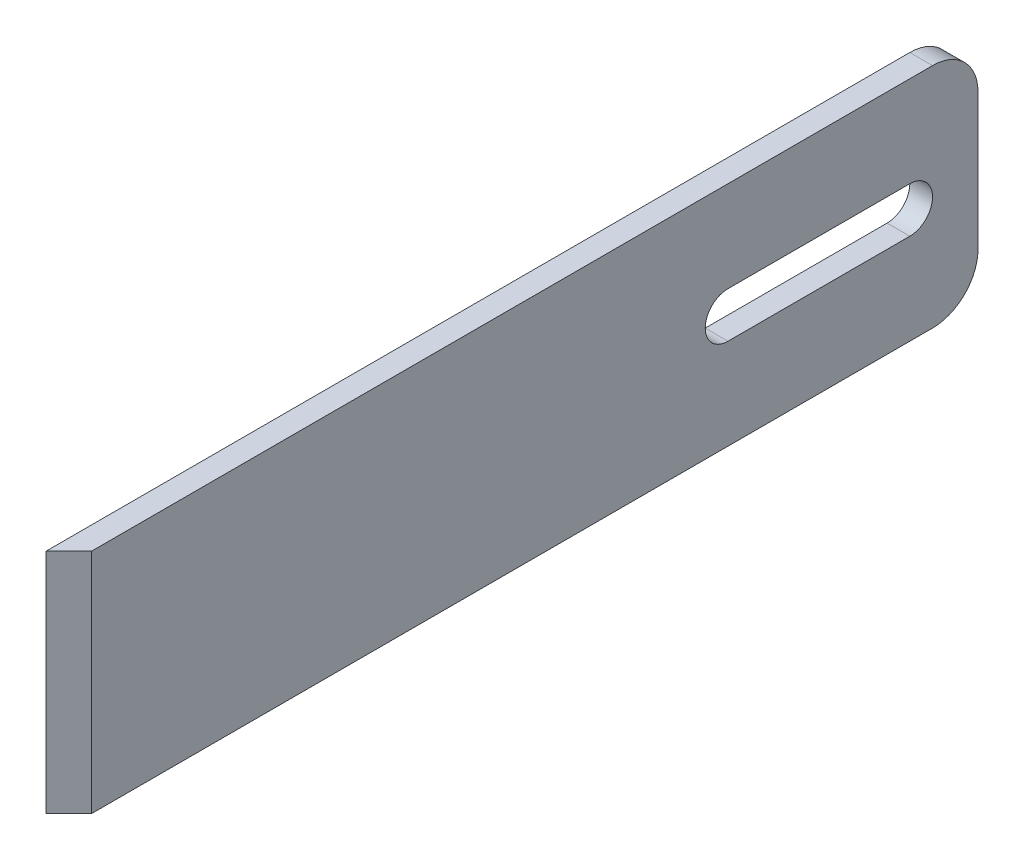
ISO-10303-21;
HEADER;
FILE_DESCRIPTION(('STEP AP214'),'2;1');
FILE_NAME('part.step','',(''),(''),'','','');
FILE_SCHEMA(('AUTOMOTIVE_DESIGN { 1 0 10303 214 1 1 1 1 }'));
ENDSEC;
DATA;
#1=APPLICATION_CONTEXT('core data for automotive mechanical design processes');
#2=APPLICATION_PROTOCOL_DEFINITION('international standard','automotive_design',2000,#1);
#3=PRODUCT_CONTEXT('',#1,'mechanical');
#4=PRODUCT('Part','Part','',(#3));
#5=PRODUCT_RELATED_PRODUCT_CATEGORY('part','',(#4));
#6=PRODUCT_DEFINITION_FORMATION('','',#4);
#7=PRODUCT_DEFINITION_CONTEXT('part definition',#1,'design');
#8=PRODUCT_DEFINITION('design','',#6,#7);
#9=PRODUCT_DEFINITION_SHAPE('','',#8);
#10=(LENGTH_UNIT() NAMED_UNIT(*) SI_UNIT(.MILLI.,.METRE.));
#11=(NAMED_UNIT(*) PLANE_ANGLE_UNIT() SI_UNIT($,.RADIAN.));
#12=(NAMED_UNIT(*) SI_UNIT($,.STERADIAN.) SOLID_ANGLE_UNIT());
#13=UNCERTAINTY_MEASURE_WITH_UNIT(LENGTH_MEASURE(1.E-05),#10,'distance_accuracy_value','');
#14=(GEOMETRIC_REPRESENTATION_CONTEXT(3) GLOBAL_UNCERTAINTY_ASSIGNED_CONTEXT((#13)) GLOBAL_UNIT_ASSIGNED_CONTEXT((#10,
#11,#12)) REPRESENTATION_CONTEXT('',''));
#15=CARTESIAN_POINT('',(0.,0.,0.));
#16=DIRECTION('',(0.,0.,1.));
#17=DIRECTION('',(1.,0.,0.));
#18=AXIS2_PLACEMENT_3D('',#15,#16,#17);
#19=CARTESIAN_POINT('',(-2.50000000000253,-24.9999999999998,-99.9999999999989));
#20=DIRECTION('',(0.,0.999999999999993,0.));
#21=DIRECTION('',(0.,0.,1.));
#22=AXIS2_PLACEMENT_3D('',#19,#20,#21);
#23=PLANE('',#22);
#24=DIRECTION('',(0.,0.,1.));
#25=VECTOR('',#24,1.);
#26=CARTESIAN_POINT('',(-2.50000000000253,-24.9999999999998,-99.9999999999989));
#27=LINE('',#26,#25);
#28=CARTESIAN_POINT('',(-2.49999999999728,-25.0000000000001,-89.999999999999));
#29=VERTEX_POINT('',#28);
#30=CARTESIAN_POINT('',(-2.50000000000003,-25.000000000001,100.000000000001));
#31=VERTEX_POINT('',#30);
#32=EDGE_CURVE('E165',#29,#31,#27,.T.);
#33=ORIENTED_EDGE('',*,*,#32,.F.);
#34=DIRECTION('',(-0.999999999999995,0.,0.));
#35=VECTOR('',#34,1.);
#36=CARTESIAN_POINT('',(-2.49999999999728,-25.0000000000001,-89.999999999999));
#37=LINE('',#36,#35);
#38=CARTESIAN_POINT('',(2.49999999999953,-25.0000000000001,-89.9999999999988));
#39=VERTEX_POINT('',#38);
#40=EDGE_CURVE('E11',#29,#39,#37,.F.);
#41=ORIENTED_EDGE('',*,*,#40,.T.);
#42=DIRECTION('',(0.,0.,1.));
#43=VECTOR('',#42,1.);
#44=CARTESIAN_POINT('',(2.50000000000003,-24.9999999999999,-99.9999999999984));
#45=LINE('',#44,#43);
#46=CARTESIAN_POINT('',(2.50000000000017,-25.0000000000001,95.0000000000012));
#47=VERTEX_POINT('',#46);
#48=EDGE_CURVE('E157',#39,#47,#45,.T.);
#49=ORIENTED_EDGE('',*,*,#48,.T.);
#50=DIRECTION('',(-0.707106781186552,0.,0.707106781186546));
#51=VECTOR('',#50,1.);
#52=CARTESIAN_POINT('',(2.50000000000017,-25.0000000000001,95.0000000000012));
#53=LINE('',#52,#51);
#54=EDGE_CURVE('E170',#47,#31,#53,.T.);
#55=ORIENTED_EDGE('',*,*,#54,.T.);
#56=EDGE_LOOP('',(#33,#41,#49,#55));
#57=FACE_BOUND('',#56,.T.);
#58=ADVANCED_FACE('F38',(#57),#23,.F.);
#59=CARTESIAN_POINT('',(-2.50000000000253,-24.9999999999998,-99.9999999999989));
#60=DIRECTION('',(0.999999999999995,0.,0.));
#61=DIRECTION('',(0.,0.,-1.));
#62=AXIS2_PLACEMENT_3D('',#59,#60,#61);
#63=PLANE('',#62);
#64=DIRECTION('',(0.,0.,-1.));
#65=VECTOR('',#64,1.);
#66=CARTESIAN_POINT('',(-2.50000000000028,5.00000000000153,-44.9999999999988));
#67=LINE('',#66,#65);
#68=CARTESIAN_POINT('',(-2.50000000000028,5.00000000000153,-44.9999999999988));
#69=VERTEX_POINT('',#68);
#70=CARTESIAN_POINT('',(-2.50000000000275,4.99999999999989,-84.9999999999991));
#71=VERTEX_POINT('',#70);
#72=EDGE_CURVE('E134',#69,#71,#67,.T.);
#73=ORIENTED_EDGE('',*,*,#72,.F.);
#74=CARTESIAN_POINT('',(-2.50000000000075,4.44089209850063E-13,-44.9999999999992));
#75=DIRECTION('',(0.999999999999995,0.,0.));
#76=DIRECTION('',(0.,0.,-1.));
#77=AXIS2_PLACEMENT_3D('',#74,#75,#76);
#78=CIRCLE('',#77,5.);
#79=CARTESIAN_POINT('',(-2.49999999999936,-5.00000000000041,-44.9999999999991));
#80=VERTEX_POINT('',#79);
#81=EDGE_CURVE('E116',#80,#69,#78,.F.);
#82=ORIENTED_EDGE('',*,*,#81,.F.);
#83=DIRECTION('',(0.,0.,1.));
#84=VECTOR('',#83,1.);
#85=CARTESIAN_POINT('',(-2.49999999999936,-5.00000000000041,-44.9999999999991));
#86=LINE('',#85,#84);
#87=CARTESIAN_POINT('',(-2.50000000000142,-5.0000000000001,-84.9999999999998));
#88=VERTEX_POINT('',#87);
#89=EDGE_CURVE('E125',#88,#80,#86,.T.);
#90=ORIENTED_EDGE('',*,*,#89,.F.);
#91=CARTESIAN_POINT('',(-2.50000000000114,3.05311331771918E-13,-84.9999999999994));
#92=DIRECTION('',(0.999999999999995,0.,0.));
#93=DIRECTION('',(0.,0.,-1.));
#94=AXIS2_PLACEMENT_3D('',#91,#92,#93);
#95=CIRCLE('',#94,5.);
#96=EDGE_CURVE('E53',#71,#88,#95,.F.);
#97=ORIENTED_EDGE('',*,*,#96,.F.);
#98=EDGE_LOOP('',(#73,#82,#90,#97));
#99=FACE_BOUND('',#98,.T.);
#100=DIRECTION('',(0.,0.,1.));
#101=VECTOR('',#100,1.);
#102=CARTESIAN_POINT('',(-2.5,24.9999999999998,-99.9999999999987));
#103=LINE('',#102,#101);
#104=CARTESIAN_POINT('',(-2.50000000000095,24.9999999999989,-89.9999999999985));
#105=VERTEX_POINT('',#104);
#106=CARTESIAN_POINT('',(-2.49999999999984,24.9999999999995,100.000000000001));
#107=VERTEX_POINT('',#106);
#108=EDGE_CURVE('E163',#105,#107,#103,.T.);
#109=ORIENTED_EDGE('',*,*,#108,.F.);
#110=CARTESIAN_POINT('',(-2.50000000000225,15.0000000000001,-89.9999999999984));
#111=DIRECTION('',(0.999999999999995,0.,0.));
#112=DIRECTION('',(0.,0.,-1.));
#113=AXIS2_PLACEMENT_3D('',#110,#111,#112);
#114=CIRCLE('',#113,10.);
#115=CARTESIAN_POINT('',(-2.50000000000145,15.,-99.9999999999985));
#116=VERTEX_POINT('',#115);
#117=EDGE_CURVE('E46',#105,#116,#114,.F.);
#118=ORIENTED_EDGE('',*,*,#117,.T.);
#119=DIRECTION('',(0.,0.999999999999993,0.));
#120=VECTOR('',#119,1.);
#121=CARTESIAN_POINT('',(-2.50000000000253,-24.9999999999998,-99.9999999999989));
#122=LINE('',#121,#120);
#123=CARTESIAN_POINT('',(-2.4999999999995,-15.0000000000002,-99.9999999999988));
#124=VERTEX_POINT('',#123);
#125=EDGE_CURVE('E151',#124,#116,#122,.T.);
#126=ORIENTED_EDGE('',*,*,#125,.F.);
#127=CARTESIAN_POINT('',(-2.50000000000361,-14.9999999999997,-89.9999999999988));
#128=DIRECTION('',(0.999999999999995,0.,0.));
#129=DIRECTION('',(0.,0.,-1.));
#130=AXIS2_PLACEMENT_3D('',#127,#128,#129);
#131=CIRCLE('',#130,10.);
#132=EDGE_CURVE('E188',#124,#29,#131,.F.);
#133=ORIENTED_EDGE('',*,*,#132,.T.);
#134=ORIENTED_EDGE('',*,*,#32,.T.);
#135=DIRECTION('',(0.,0.999999999999993,0.));
#136=VECTOR('',#135,1.);
#137=CARTESIAN_POINT('',(-2.50000000000003,-25.000000000001,100.000000000001));
#138=LINE('',#137,#136);
#139=EDGE_CURVE('E128',#31,#107,#138,.T.);
#140=ORIENTED_EDGE('',*,*,#139,.T.);
#141=EDGE_LOOP('',(#109,#118,#126,#133,#134,#140));
#142=FACE_BOUND('',#141,.T.);
#143=ADVANCED_FACE('F131',(#99,#142),#63,.F.);
#144=CARTESIAN_POINT('',(2.49999999999978,24.9999999999997,-99.9999999999977));
#145=DIRECTION('',(0.,-0.999999999999993,0.));
#146=DIRECTION('',(0.,0.,-1.));
#147=AXIS2_PLACEMENT_3D('',#144,#145,#146);
#148=PLANE('',#147);
#149=DIRECTION('',(0.,0.,1.));
#150=VECTOR('',#149,1.);
#151=CARTESIAN_POINT('',(2.49999999999978,24.9999999999997,-99.9999999999977));
#152=LINE('',#151,#150);
#153=CARTESIAN_POINT('',(2.49999999999953,25.0000000000004,-89.999999999999));
#154=VERTEX_POINT('',#153);
#155=CARTESIAN_POINT('',(2.50000000000031,24.9999999999985,95.0000000000005));
#156=VERTEX_POINT('',#155);
#157=EDGE_CURVE('E161',#154,#156,#152,.T.);
#158=ORIENTED_EDGE('',*,*,#157,.F.);
#159=DIRECTION('',(0.999999999999995,0.,0.));
#160=VECTOR('',#159,1.);
#161=CARTESIAN_POINT('',(2.49999999999953,25.0000000000004,-89.999999999999));
#162=LINE('',#161,#160);
#163=EDGE_CURVE('E186',#154,#105,#162,.F.);
#164=ORIENTED_EDGE('',*,*,#163,.T.);
#165=ORIENTED_EDGE('',*,*,#108,.T.);
#166=DIRECTION('',(0.707106781186552,0.,-0.707106781186546));
#167=VECTOR('',#166,1.);
#168=CARTESIAN_POINT('',(2.50000000000031,24.9999999999985,95.0000000000005));
#169=LINE('',#168,#167);
#170=EDGE_CURVE('E173',#107,#156,#169,.T.);
#171=ORIENTED_EDGE('',*,*,#170,.T.);
#172=EDGE_LOOP('',(#158,#164,#165,#171));
#173=FACE_BOUND('',#172,.T.);
#174=ADVANCED_FACE('F204',(#173),#148,.F.);
#175=CARTESIAN_POINT('',(2.50000000000003,-24.9999999999999,-99.9999999999984));
#176=DIRECTION('',(-0.999999999999995,0.,0.));
#177=DIRECTION('',(0.,0.,1.));
#178=AXIS2_PLACEMENT_3D('',#175,#176,#177);
#179=PLANE('',#178);
#180=DIRECTION('',(0.,0.,-1.));
#181=VECTOR('',#180,1.);
#182=CARTESIAN_POINT('',(2.49999999999931,-5.00000000000049,-44.9999999999992));
#183=LINE('',#182,#181);
#184=CARTESIAN_POINT('',(2.49999999999931,-5.00000000000049,-44.9999999999992));
#185=VERTEX_POINT('',#184);
#186=CARTESIAN_POINT('',(2.49999999999584,-4.99999999999967,-84.9999999999993));
#187=VERTEX_POINT('',#186);
#188=EDGE_CURVE('E136',#185,#187,#183,.T.);
#189=ORIENTED_EDGE('',*,*,#188,.F.);
#190=CARTESIAN_POINT('',(2.49999999999614,-6.38378239159465E-13,-44.9999999999997));
#191=DIRECTION('',(0.999999999999995,0.,0.));
#192=DIRECTION('',(0.,0.,-1.));
#193=AXIS2_PLACEMENT_3D('',#190,#191,#192);
#194=CIRCLE('',#193,5.);
#195=CARTESIAN_POINT('',(2.50000000000478,5.00000000000149,-44.9999999999993));
#196=VERTEX_POINT('',#195);
#197=EDGE_CURVE('E61',#196,#185,#194,.T.);
#198=ORIENTED_EDGE('',*,*,#197,.F.);
#199=DIRECTION('',(0.,0.,1.));
#200=VECTOR('',#199,1.);
#201=CARTESIAN_POINT('',(2.50000000000478,5.00000000000149,-44.9999999999993));
#202=LINE('',#201,#200);
#203=CARTESIAN_POINT('',(2.49999999999778,4.99999999999988,-85.));
#204=VERTEX_POINT('',#203);
#205=EDGE_CURVE('E122',#204,#196,#202,.T.);
#206=ORIENTED_EDGE('',*,*,#205,.F.);
#207=CARTESIAN_POINT('',(2.49999999999745,1.65145674912992E-12,-84.9999999999987));
#208=DIRECTION('',(0.999999999999995,0.,0.));
#209=DIRECTION('',(0.,0.,-1.));
#210=AXIS2_PLACEMENT_3D('',#207,#208,#209);
#211=CIRCLE('',#210,5.);
#212=EDGE_CURVE('E142',#187,#204,#211,.T.);
#213=ORIENTED_EDGE('',*,*,#212,.F.);
#214=EDGE_LOOP('',(#189,#198,#206,#213));
#215=FACE_BOUND('',#214,.T.);
#216=DIRECTION('',(0.,-0.999999999999993,0.));
#217=VECTOR('',#216,1.);
#218=CARTESIAN_POINT('',(2.50000000000003,-24.9999999999999,-99.9999999999984));
#219=LINE('',#218,#217);
#220=CARTESIAN_POINT('',(2.49999999999209,15.0000000000001,-99.9999999999995));
#221=VERTEX_POINT('',#220);
#222=CARTESIAN_POINT('',(2.49999999999723,-15.0000000000001,-99.9999999999983));
#223=VERTEX_POINT('',#222);
#224=EDGE_CURVE('E154',#221,#223,#219,.T.);
#225=ORIENTED_EDGE('',*,*,#224,.F.);
#226=CARTESIAN_POINT('',(2.49999999999512,14.999999999999,-89.9999999999992));
#227=DIRECTION('',(-0.999999999999995,0.,0.));
#228=DIRECTION('',(0.,0.,1.));
#229=AXIS2_PLACEMENT_3D('',#226,#227,#228);
#230=CIRCLE('',#229,10.);
#231=EDGE_CURVE('E184',#221,#154,#230,.F.);
#232=ORIENTED_EDGE('',*,*,#231,.T.);
#233=ORIENTED_EDGE('',*,*,#157,.T.);
#234=DIRECTION('',(0.,-0.999999999999993,0.));
#235=VECTOR('',#234,1.);
#236=CARTESIAN_POINT('',(2.50000000000017,-25.0000000000001,95.0000000000012));
#237=LINE('',#236,#235);
#238=EDGE_CURVE('E167',#156,#47,#237,.T.);
#239=ORIENTED_EDGE('',*,*,#238,.T.);
#240=ORIENTED_EDGE('',*,*,#48,.F.);
#241=CARTESIAN_POINT('',(2.49999999999712,-15.0000000000001,-90.));
#242=DIRECTION('',(-0.999999999999995,0.,0.));
#243=DIRECTION('',(0.,0.,1.));
#244=AXIS2_PLACEMENT_3D('',#241,#242,#243);
#245=CIRCLE('',#244,10.);
#246=EDGE_CURVE('E182',#39,#223,#245,.F.);
#247=ORIENTED_EDGE('',*,*,#246,.T.);
#248=EDGE_LOOP('',(#225,#232,#233,#239,#240,#247));
#249=FACE_BOUND('',#248,.T.);
#250=ADVANCED_FACE('F202',(#215,#249),#179,.F.);
#251=CARTESIAN_POINT('',(-8.1601392309949E-12,6.10622663543836E-13,-99.9999999999982));
#252=DIRECTION('',(0.,0.,1.));
#253=DIRECTION('',(0.999999999999995,0.,0.));
#254=AXIS2_PLACEMENT_3D('',#251,#252,#253);
#255=PLANE('',#254);
#256=ORIENTED_EDGE('',*,*,#125,.T.);
#257=DIRECTION('',(0.999999999999995,0.,0.));
#258=VECTOR('',#257,1.);
#259=CARTESIAN_POINT('',(-3.38618022510673E-12,14.9999999999991,-99.9999999999974));
#260=LINE('',#259,#258);
#261=EDGE_CURVE('E179',#116,#221,#260,.T.);
#262=ORIENTED_EDGE('',*,*,#261,.T.);
#263=ORIENTED_EDGE('',*,*,#224,.T.);
#264=DIRECTION('',(-0.999999999999995,0.,0.));
#265=VECTOR('',#264,1.);
#266=CARTESIAN_POINT('',(-4.9960036108132E-12,-15.0000000000001,-99.9999999999982));
#267=LINE('',#266,#265);
#268=EDGE_CURVE('E176',#223,#124,#267,.T.);
#269=ORIENTED_EDGE('',*,*,#268,.T.);
#270=EDGE_LOOP('',(#256,#262,#263,#269));
#271=FACE_BOUND('',#270,.T.);
#272=ADVANCED_FACE('F196',(#271),#255,.F.);
#273=CARTESIAN_POINT('',(2.50000000000017,-25.0000000000001,95.0000000000012));
#274=DIRECTION('',(0.707106781186545,0.,0.707106781186554));
#275=DIRECTION('',(0.,0.999999999999993,0.));
#276=AXIS2_PLACEMENT_3D('',#273,#274,#275);
#277=PLANE('',#276);
#278=ORIENTED_EDGE('',*,*,#170,.F.);
#279=ORIENTED_EDGE('',*,*,#139,.F.);
#280=ORIENTED_EDGE('',*,*,#54,.F.);
#281=ORIENTED_EDGE('',*,*,#238,.F.);
#282=EDGE_LOOP('',(#278,#279,#280,#281));
#283=FACE_BOUND('',#282,.T.);
#284=ADVANCED_FACE('F210',(#283),#277,.T.);
#285=CARTESIAN_POINT('',(-1.94289029309402E-13,14.9999999999988,-89.9999999999979));
#286=DIRECTION('',(0.999999999999995,0.,0.));
#287=DIRECTION('',(0.,0.,-1.));
#288=AXIS2_PLACEMENT_3D('',#285,#286,#287);
#289=CYLINDRICAL_SURFACE('',#288,10.);
#290=ORIENTED_EDGE('',*,*,#117,.F.);
#291=ORIENTED_EDGE('',*,*,#163,.F.);
#292=ORIENTED_EDGE('',*,*,#231,.F.);
#293=ORIENTED_EDGE('',*,*,#261,.F.);
#294=EDGE_LOOP('',(#290,#291,#292,#293));
#295=FACE_BOUND('',#294,.T.);
#296=ADVANCED_FACE('F199',(#295),#289,.T.);
#297=CARTESIAN_POINT('',(-3.5527136788005E-12,-15.0000000000001,-89.9999999999976));
#298=DIRECTION('',(-0.999999999999995,0.,0.));
#299=DIRECTION('',(0.,0.,1.));
#300=AXIS2_PLACEMENT_3D('',#297,#298,#299);
#301=CYLINDRICAL_SURFACE('',#300,10.);
#302=ORIENTED_EDGE('',*,*,#246,.F.);
#303=ORIENTED_EDGE('',*,*,#40,.F.);
#304=ORIENTED_EDGE('',*,*,#132,.F.);
#305=ORIENTED_EDGE('',*,*,#268,.F.);
#306=EDGE_LOOP('',(#302,#303,#304,#305));
#307=FACE_BOUND('',#306,.T.);
#308=ADVANCED_FACE('F40',(#307),#301,.T.);
#309=CARTESIAN_POINT('',(-2.50099999999853,3.60822483003176E-13,-44.9999999999988));
#310=DIRECTION('',(0.999999999999995,0.,0.));
#311=DIRECTION('',(0.,0.,-1.));
#312=AXIS2_PLACEMENT_3D('',#309,#310,#311);
#313=CYLINDRICAL_SURFACE('',#312,5.);
#314=ORIENTED_EDGE('',*,*,#81,.T.);
#315=DIRECTION('',(0.999999999999995,0.,0.));
#316=VECTOR('',#315,1.);
#317=CARTESIAN_POINT('',(-2.50100000000103,5.00000000000241,-44.9999999999989));
#318=LINE('',#317,#316);
#319=EDGE_CURVE('E129',#69,#196,#318,.T.);
#320=ORIENTED_EDGE('',*,*,#319,.T.);
#321=ORIENTED_EDGE('',*,*,#197,.T.);
#322=DIRECTION('',(0.999999999999995,0.,0.));
#323=VECTOR('',#322,1.);
#324=CARTESIAN_POINT('',(-2.50100000000444,-4.99999999999885,-44.999999999999));
#325=LINE('',#324,#323);
#326=EDGE_CURVE('E112',#80,#185,#325,.T.);
#327=ORIENTED_EDGE('',*,*,#326,.F.);
#328=EDGE_LOOP('',(#314,#320,#321,#327));
#329=FACE_BOUND('',#328,.T.);
#330=ADVANCED_FACE('F114',(#329),#313,.F.);
#331=CARTESIAN_POINT('',(-2.50100000000103,5.00000000000241,-44.9999999999989));
#332=DIRECTION('',(0.,0.999999999999993,0.));
#333=DIRECTION('',(0.,0.,1.));
#334=AXIS2_PLACEMENT_3D('',#331,#332,#333);
#335=PLANE('',#334);
#336=ORIENTED_EDGE('',*,*,#72,.T.);
#337=DIRECTION('',(0.999999999999995,0.,0.));
#338=VECTOR('',#337,1.);
#339=CARTESIAN_POINT('',(-2.50100000000603,4.99999999999982,-85.));
#340=LINE('',#339,#338);
#341=EDGE_CURVE('E148',#71,#204,#340,.T.);
#342=ORIENTED_EDGE('',*,*,#341,.T.);
#343=ORIENTED_EDGE('',*,*,#205,.T.);
#344=ORIENTED_EDGE('',*,*,#319,.F.);
#345=EDGE_LOOP('',(#336,#342,#343,#344));
#346=FACE_BOUND('',#345,.T.);
#347=ADVANCED_FACE('F233',(#346),#335,.F.);
#348=CARTESIAN_POINT('',(-2.50099999999523,2.35922392732846E-13,-84.9999999999987));
#349=DIRECTION('',(0.999999999999995,0.,0.));
#350=DIRECTION('',(0.,0.,-1.));
#351=AXIS2_PLACEMENT_3D('',#348,#349,#350);
#352=CYLINDRICAL_SURFACE('',#351,5.);
#353=ORIENTED_EDGE('',*,*,#96,.T.);
#354=DIRECTION('',(0.999999999999995,0.,0.));
#355=VECTOR('',#354,1.);
#356=CARTESIAN_POINT('',(-2.50100000000403,-4.99999999999967,-84.9999999999994));
#357=LINE('',#356,#355);
#358=EDGE_CURVE('E121',#88,#187,#357,.T.);
#359=ORIENTED_EDGE('',*,*,#358,.T.);
#360=ORIENTED_EDGE('',*,*,#212,.T.);
#361=ORIENTED_EDGE('',*,*,#341,.F.);
#362=EDGE_LOOP('',(#353,#359,#360,#361));
#363=FACE_BOUND('',#362,.T.);
#364=ADVANCED_FACE('F238',(#363),#352,.F.);
#365=CARTESIAN_POINT('',(-2.50100000000444,-4.99999999999885,-44.999999999999));
#366=DIRECTION('',(0.,-0.999999999999993,0.));
#367=DIRECTION('',(0.,0.,-1.));
#368=AXIS2_PLACEMENT_3D('',#365,#366,#367);
#369=PLANE('',#368);
#370=ORIENTED_EDGE('',*,*,#89,.T.);
#371=ORIENTED_EDGE('',*,*,#326,.T.);
#372=ORIENTED_EDGE('',*,*,#188,.T.);
#373=ORIENTED_EDGE('',*,*,#358,.F.);
#374=EDGE_LOOP('',(#370,#371,#372,#373));
#375=FACE_BOUND('',#374,.T.);
#376=ADVANCED_FACE('F126',(#375),#369,.F.);
#377=CLOSED_SHELL('',(#58,#143,#174,#250,#272,#284,#296,#308,#330,#347,#364,#376));
#378=MANIFOLD_SOLID_BREP('B2',#377);
#379=ADVANCED_BREP_SHAPE_REPRESENTATION('',(#18,#378),#14);
#380=SHAPE_DEFINITION_REPRESENTATION(#9,#379);
ENDSEC;
END-ISO-10303-21;
